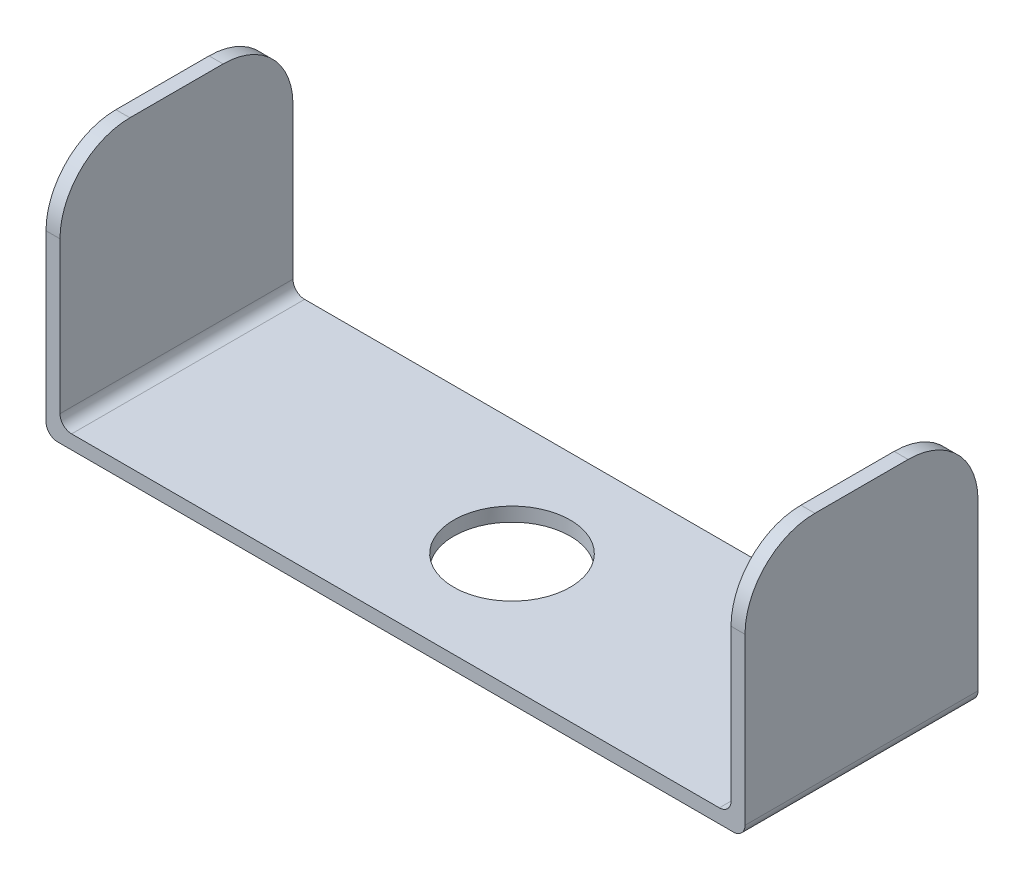
ISO-10303-21;
HEADER;
FILE_DESCRIPTION(('STEP AP214'),'2;1');
FILE_NAME('part.step','',(''),(''),'','','');
FILE_SCHEMA(('AUTOMOTIVE_DESIGN { 1 0 10303 214 1 1 1 1 }'));
ENDSEC;
DATA;
#1=APPLICATION_CONTEXT('core data for automotive mechanical design processes');
#2=APPLICATION_PROTOCOL_DEFINITION('international standard','automotive_design',2000,#1);
#3=PRODUCT_CONTEXT('',#1,'mechanical');
#4=PRODUCT('Part','Part','',(#3));
#5=PRODUCT_RELATED_PRODUCT_CATEGORY('part','',(#4));
#6=PRODUCT_DEFINITION_FORMATION('','',#4);
#7=PRODUCT_DEFINITION_CONTEXT('part definition',#1,'design');
#8=PRODUCT_DEFINITION('design','',#6,#7);
#9=PRODUCT_DEFINITION_SHAPE('','',#8);
#10=(LENGTH_UNIT() NAMED_UNIT(*) SI_UNIT(.MILLI.,.METRE.));
#11=(NAMED_UNIT(*) PLANE_ANGLE_UNIT() SI_UNIT($,.RADIAN.));
#12=(NAMED_UNIT(*) SI_UNIT($,.STERADIAN.) SOLID_ANGLE_UNIT());
#13=UNCERTAINTY_MEASURE_WITH_UNIT(LENGTH_MEASURE(1.E-05),#10,'distance_accuracy_value','');
#14=(GEOMETRIC_REPRESENTATION_CONTEXT(3) GLOBAL_UNCERTAINTY_ASSIGNED_CONTEXT((#13)) GLOBAL_UNIT_ASSIGNED_CONTEXT((#10,
#11,#12)) REPRESENTATION_CONTEXT('',''));
#15=CARTESIAN_POINT('',(0.,0.,0.));
#16=DIRECTION('',(0.,0.,1.));
#17=DIRECTION('',(1.,0.,0.));
#18=AXIS2_PLACEMENT_3D('',#15,#16,#17);
#19=CARTESIAN_POINT('',(0.,0.6,0.));
#20=DIRECTION('',(0.,-1.,0.));
#21=DIRECTION('',(0.,0.,-1.));
#22=AXIS2_PLACEMENT_3D('',#19,#20,#21);
#23=PLANE('',#22);
#24=CARTESIAN_POINT('',(0.,0.6,0.));
#25=DIRECTION('',(0.,1.,0.));
#26=DIRECTION('',(0.,0.,1.));
#27=AXIS2_PLACEMENT_3D('',#24,#25,#26);
#28=CIRCLE('',#27,2.5);
#29=CARTESIAN_POINT('',(0.,0.6,2.5));
#30=VERTEX_POINT('',#29);
#31=EDGE_CURVE('E255',#30,#30,#28,.T.);
#32=ORIENTED_EDGE('',*,*,#31,.F.);
#33=EDGE_LOOP('',(#32));
#34=FACE_BOUND('',#33,.T.);
#35=DIRECTION('',(1.,0.,0.));
#36=VECTOR('',#35,1.);
#37=CARTESIAN_POINT('',(-15.,0.6,5.));
#38=LINE('',#37,#36);
#39=CARTESIAN_POINT('',(-13.9,0.6,5.));
#40=VERTEX_POINT('',#39);
#41=CARTESIAN_POINT('',(13.9,0.6,5.));
#42=VERTEX_POINT('',#41);
#43=EDGE_CURVE('E246',#40,#42,#38,.T.);
#44=ORIENTED_EDGE('',*,*,#43,.T.);
#45=DIRECTION('',(0.,0.,1.));
#46=VECTOR('',#45,1.);
#47=CARTESIAN_POINT('',(13.9,0.6,-5.));
#48=LINE('',#47,#46);
#49=CARTESIAN_POINT('',(13.9,0.6,-5.));
#50=VERTEX_POINT('',#49);
#51=EDGE_CURVE('E190',#42,#50,#48,.F.);
#52=ORIENTED_EDGE('',*,*,#51,.T.);
#53=DIRECTION('',(-1.,0.,0.));
#54=VECTOR('',#53,1.);
#55=CARTESIAN_POINT('',(-15.,0.6,-5.));
#56=LINE('',#55,#54);
#57=CARTESIAN_POINT('',(-13.9,0.6,-5.));
#58=VERTEX_POINT('',#57);
#59=EDGE_CURVE('E271',#50,#58,#56,.T.);
#60=ORIENTED_EDGE('',*,*,#59,.T.);
#61=DIRECTION('',(0.,0.,-1.));
#62=VECTOR('',#61,1.);
#63=CARTESIAN_POINT('',(-13.9,0.6,5.));
#64=LINE('',#63,#62);
#65=EDGE_CURVE('E188',#58,#40,#64,.F.);
#66=ORIENTED_EDGE('',*,*,#65,.T.);
#67=EDGE_LOOP('',(#44,#52,#60,#66));
#68=FACE_BOUND('',#67,.T.);
#69=ADVANCED_FACE('F32',(#34,#68),#23,.F.);
#70=CARTESIAN_POINT('',(15.,0.6,5.));
#71=DIRECTION('',(-1.,0.,0.));
#72=DIRECTION('',(0.,0.,1.));
#73=AXIS2_PLACEMENT_3D('',#70,#71,#72);
#74=PLANE('',#73);
#75=DIRECTION('',(0.,-1.,0.));
#76=VECTOR('',#75,1.);
#77=CARTESIAN_POINT('',(15.,0.6,-5.));
#78=LINE('',#77,#76);
#79=CARTESIAN_POINT('',(15.,7.6,-5.));
#80=VERTEX_POINT('',#79);
#81=CARTESIAN_POINT('',(15.,0.5,-5.));
#82=VERTEX_POINT('',#81);
#83=EDGE_CURVE('E146',#80,#82,#78,.T.);
#84=ORIENTED_EDGE('',*,*,#83,.F.);
#85=CARTESIAN_POINT('',(15.,7.6,-2.));
#86=DIRECTION('',(-1.,0.,0.));
#87=DIRECTION('',(0.,0.,1.));
#88=AXIS2_PLACEMENT_3D('',#85,#86,#87);
#89=CIRCLE('',#88,3.);
#90=CARTESIAN_POINT('',(15.,10.6,-2.));
#91=VERTEX_POINT('',#90);
#92=EDGE_CURVE('E11',#80,#91,#89,.F.);
#93=ORIENTED_EDGE('',*,*,#92,.T.);
#94=DIRECTION('',(0.,0.,-1.));
#95=VECTOR('',#94,1.);
#96=CARTESIAN_POINT('',(15.,10.6,-5.));
#97=LINE('',#96,#95);
#98=CARTESIAN_POINT('',(15.,10.6,2.));
#99=VERTEX_POINT('',#98);
#100=EDGE_CURVE('E237',#99,#91,#97,.T.);
#101=ORIENTED_EDGE('',*,*,#100,.F.);
#102=CARTESIAN_POINT('',(15.,7.6,2.));
#103=DIRECTION('',(-1.,0.,0.));
#104=DIRECTION('',(0.,0.,1.));
#105=AXIS2_PLACEMENT_3D('',#102,#103,#104);
#106=CIRCLE('',#105,3.);
#107=CARTESIAN_POINT('',(15.,7.6,5.));
#108=VERTEX_POINT('',#107);
#109=EDGE_CURVE('E40',#99,#108,#106,.F.);
#110=ORIENTED_EDGE('',*,*,#109,.T.);
#111=DIRECTION('',(0.,-1.,0.));
#112=VECTOR('',#111,1.);
#113=CARTESIAN_POINT('',(15.,0.6,5.));
#114=LINE('',#113,#112);
#115=CARTESIAN_POINT('',(15.,0.5,5.));
#116=VERTEX_POINT('',#115);
#117=EDGE_CURVE('E172',#108,#116,#114,.T.);
#118=ORIENTED_EDGE('',*,*,#117,.T.);
#119=DIRECTION('',(0.,0.,-1.));
#120=VECTOR('',#119,1.);
#121=CARTESIAN_POINT('',(15.,0.5,-5.));
#122=LINE('',#121,#120);
#123=EDGE_CURVE('E158',#116,#82,#122,.T.);
#124=ORIENTED_EDGE('',*,*,#123,.T.);
#125=EDGE_LOOP('',(#84,#93,#101,#110,#118,#124));
#126=FACE_BOUND('',#125,.T.);
#127=ADVANCED_FACE('F170',(#126),#74,.F.);
#128=CARTESIAN_POINT('',(-15.,0.6,-5.));
#129=DIRECTION('',(0.,0.,1.));
#130=DIRECTION('',(1.,0.,0.));
#131=AXIS2_PLACEMENT_3D('',#128,#129,#130);
#132=PLANE('',#131);
#133=DIRECTION('',(0.,-1.,0.));
#134=VECTOR('',#133,1.);
#135=CARTESIAN_POINT('',(-15.,0.6,-5.));
#136=LINE('',#135,#134);
#137=CARTESIAN_POINT('',(-15.,7.6,-5.));
#138=VERTEX_POINT('',#137);
#139=CARTESIAN_POINT('',(-15.,0.5,-5.));
#140=VERTEX_POINT('',#139);
#141=EDGE_CURVE('E159',#138,#140,#136,.T.);
#142=ORIENTED_EDGE('',*,*,#141,.F.);
#143=DIRECTION('',(-1.,0.,0.));
#144=VECTOR('',#143,1.);
#145=CARTESIAN_POINT('',(-14.4,7.6,-5.));
#146=LINE('',#145,#144);
#147=CARTESIAN_POINT('',(-14.4,7.6,-5.));
#148=VERTEX_POINT('',#147);
#149=EDGE_CURVE('E219',#138,#148,#146,.F.);
#150=ORIENTED_EDGE('',*,*,#149,.T.);
#151=DIRECTION('',(0.,-1.,0.));
#152=VECTOR('',#151,1.);
#153=CARTESIAN_POINT('',(-14.4,10.6,-5.));
#154=LINE('',#153,#152);
#155=CARTESIAN_POINT('',(-14.4,1.1,-5.));
#156=VERTEX_POINT('',#155);
#157=EDGE_CURVE('E266',#148,#156,#154,.T.);
#158=ORIENTED_EDGE('',*,*,#157,.T.);
#159=CARTESIAN_POINT('',(-13.9,1.1,-5.));
#160=DIRECTION('',(0.,0.,1.));
#161=DIRECTION('',(1.,0.,0.));
#162=AXIS2_PLACEMENT_3D('',#159,#160,#161);
#163=CIRCLE('',#162,0.5);
#164=EDGE_CURVE('E203',#156,#58,#163,.T.);
#165=ORIENTED_EDGE('',*,*,#164,.T.);
#166=ORIENTED_EDGE('',*,*,#59,.F.);
#167=CARTESIAN_POINT('',(13.9,1.1,-5.));
#168=DIRECTION('',(0.,0.,1.));
#169=DIRECTION('',(1.,0.,0.));
#170=AXIS2_PLACEMENT_3D('',#167,#168,#169);
#171=CIRCLE('',#170,0.5);
#172=CARTESIAN_POINT('',(14.4,1.1,-5.));
#173=VERTEX_POINT('',#172);
#174=EDGE_CURVE('E200',#50,#173,#171,.T.);
#175=ORIENTED_EDGE('',*,*,#174,.T.);
#176=DIRECTION('',(0.,-1.,0.));
#177=VECTOR('',#176,1.);
#178=CARTESIAN_POINT('',(14.4,10.6,-5.));
#179=LINE('',#178,#177);
#180=CARTESIAN_POINT('',(14.4,7.6,-5.));
#181=VERTEX_POINT('',#180);
#182=EDGE_CURVE('E253',#181,#173,#179,.T.);
#183=ORIENTED_EDGE('',*,*,#182,.F.);
#184=DIRECTION('',(-1.,0.,0.));
#185=VECTOR('',#184,1.);
#186=CARTESIAN_POINT('',(-15.,7.6,-5.));
#187=LINE('',#186,#185);
#188=EDGE_CURVE('E154',#181,#80,#187,.F.);
#189=ORIENTED_EDGE('',*,*,#188,.T.);
#190=ORIENTED_EDGE('',*,*,#83,.T.);
#191=CARTESIAN_POINT('',(14.5,0.5,-5.));
#192=DIRECTION('',(0.,0.,1.));
#193=DIRECTION('',(1.,0.,0.));
#194=AXIS2_PLACEMENT_3D('',#191,#192,#193);
#195=CIRCLE('',#194,0.5);
#196=CARTESIAN_POINT('',(14.5,0.,-5.));
#197=VERTEX_POINT('',#196);
#198=EDGE_CURVE('E151',#82,#197,#195,.F.);
#199=ORIENTED_EDGE('',*,*,#198,.T.);
#200=DIRECTION('',(-1.,0.,0.));
#201=VECTOR('',#200,1.);
#202=CARTESIAN_POINT('',(-15.,0.,-5.));
#203=LINE('',#202,#201);
#204=CARTESIAN_POINT('',(-14.5,0.,-5.));
#205=VERTEX_POINT('',#204);
#206=EDGE_CURVE('E270',#197,#205,#203,.T.);
#207=ORIENTED_EDGE('',*,*,#206,.T.);
#208=CARTESIAN_POINT('',(-14.5,0.5,-5.));
#209=DIRECTION('',(0.,0.,1.));
#210=DIRECTION('',(1.,0.,0.));
#211=AXIS2_PLACEMENT_3D('',#208,#209,#210);
#212=CIRCLE('',#211,0.5);
#213=EDGE_CURVE('E168',#205,#140,#212,.F.);
#214=ORIENTED_EDGE('',*,*,#213,.T.);
#215=EDGE_LOOP('',(#142,#150,#158,#165,#166,#175,#183,#189,#190,#199,#207,#214));
#216=FACE_BOUND('',#215,.T.);
#217=ADVANCED_FACE('F149',(#216),#132,.F.);
#218=CARTESIAN_POINT('',(-15.,0.6,5.));
#219=DIRECTION('',(1.,0.,0.));
#220=DIRECTION('',(0.,0.,-1.));
#221=AXIS2_PLACEMENT_3D('',#218,#219,#220);
#222=PLANE('',#221);
#223=DIRECTION('',(0.,0.,1.));
#224=VECTOR('',#223,1.);
#225=CARTESIAN_POINT('',(-15.,10.6,-5.));
#226=LINE('',#225,#224);
#227=CARTESIAN_POINT('',(-15.,10.6,-2.));
#228=VERTEX_POINT('',#227);
#229=CARTESIAN_POINT('',(-15.,10.6,2.));
#230=VERTEX_POINT('',#229);
#231=EDGE_CURVE('E260',#228,#230,#226,.T.);
#232=ORIENTED_EDGE('',*,*,#231,.F.);
#233=CARTESIAN_POINT('',(-15.,7.6,-2.));
#234=DIRECTION('',(1.,0.,0.));
#235=DIRECTION('',(0.,0.,-1.));
#236=AXIS2_PLACEMENT_3D('',#233,#234,#235);
#237=CIRCLE('',#236,3.);
#238=EDGE_CURVE('E216',#228,#138,#237,.F.);
#239=ORIENTED_EDGE('',*,*,#238,.T.);
#240=ORIENTED_EDGE('',*,*,#141,.T.);
#241=DIRECTION('',(0.,0.,1.));
#242=VECTOR('',#241,1.);
#243=CARTESIAN_POINT('',(-15.,0.5,5.));
#244=LINE('',#243,#242);
#245=CARTESIAN_POINT('',(-15.,0.5,5.));
#246=VERTEX_POINT('',#245);
#247=EDGE_CURVE('E192',#140,#246,#244,.T.);
#248=ORIENTED_EDGE('',*,*,#247,.T.);
#249=DIRECTION('',(0.,-1.,0.));
#250=VECTOR('',#249,1.);
#251=CARTESIAN_POINT('',(-15.,0.6,5.));
#252=LINE('',#251,#250);
#253=CARTESIAN_POINT('',(-15.,7.6,5.));
#254=VERTEX_POINT('',#253);
#255=EDGE_CURVE('E245',#254,#246,#252,.T.);
#256=ORIENTED_EDGE('',*,*,#255,.F.);
#257=CARTESIAN_POINT('',(-15.,7.6,2.));
#258=DIRECTION('',(1.,0.,0.));
#259=DIRECTION('',(0.,0.,-1.));
#260=AXIS2_PLACEMENT_3D('',#257,#258,#259);
#261=CIRCLE('',#260,3.);
#262=EDGE_CURVE('E214',#254,#230,#261,.F.);
#263=ORIENTED_EDGE('',*,*,#262,.T.);
#264=EDGE_LOOP('',(#232,#239,#240,#248,#256,#263));
#265=FACE_BOUND('',#264,.T.);
#266=ADVANCED_FACE('F281',(#265),#222,.F.);
#267=CARTESIAN_POINT('',(-15.,0.6,5.));
#268=DIRECTION('',(0.,0.,-1.));
#269=DIRECTION('',(-1.,0.,0.));
#270=AXIS2_PLACEMENT_3D('',#267,#268,#269);
#271=PLANE('',#270);
#272=DIRECTION('',(0.,-1.,0.));
#273=VECTOR('',#272,1.);
#274=CARTESIAN_POINT('',(-14.4,10.6,5.));
#275=LINE('',#274,#273);
#276=CARTESIAN_POINT('',(-14.4,7.6,5.));
#277=VERTEX_POINT('',#276);
#278=CARTESIAN_POINT('',(-14.4,1.1,5.));
#279=VERTEX_POINT('',#278);
#280=EDGE_CURVE('E268',#277,#279,#275,.T.);
#281=ORIENTED_EDGE('',*,*,#280,.F.);
#282=DIRECTION('',(1.,0.,0.));
#283=VECTOR('',#282,1.);
#284=CARTESIAN_POINT('',(-15.,7.6,5.));
#285=LINE('',#284,#283);
#286=EDGE_CURVE('E227',#277,#254,#285,.F.);
#287=ORIENTED_EDGE('',*,*,#286,.T.);
#288=ORIENTED_EDGE('',*,*,#255,.T.);
#289=CARTESIAN_POINT('',(-14.5,0.5,5.));
#290=DIRECTION('',(0.,0.,-1.));
#291=DIRECTION('',(-1.,0.,0.));
#292=AXIS2_PLACEMENT_3D('',#289,#290,#291);
#293=CIRCLE('',#292,0.5);
#294=CARTESIAN_POINT('',(-14.5,0.,5.));
#295=VERTEX_POINT('',#294);
#296=EDGE_CURVE('E181',#246,#295,#293,.F.);
#297=ORIENTED_EDGE('',*,*,#296,.T.);
#298=DIRECTION('',(1.,0.,0.));
#299=VECTOR('',#298,1.);
#300=CARTESIAN_POINT('',(-15.,0.,5.));
#301=LINE('',#300,#299);
#302=CARTESIAN_POINT('',(14.5,0.,5.));
#303=VERTEX_POINT('',#302);
#304=EDGE_CURVE('E274',#295,#303,#301,.T.);
#305=ORIENTED_EDGE('',*,*,#304,.T.);
#306=CARTESIAN_POINT('',(14.5,0.5,5.));
#307=DIRECTION('',(0.,0.,-1.));
#308=DIRECTION('',(-1.,0.,0.));
#309=AXIS2_PLACEMENT_3D('',#306,#307,#308);
#310=CIRCLE('',#309,0.5);
#311=EDGE_CURVE('E183',#303,#116,#310,.F.);
#312=ORIENTED_EDGE('',*,*,#311,.T.);
#313=ORIENTED_EDGE('',*,*,#117,.F.);
#314=DIRECTION('',(1.,0.,0.));
#315=VECTOR('',#314,1.);
#316=CARTESIAN_POINT('',(-15.,7.6,5.));
#317=LINE('',#316,#315);
#318=CARTESIAN_POINT('',(14.4,7.6,5.));
#319=VERTEX_POINT('',#318);
#320=EDGE_CURVE('E225',#108,#319,#317,.F.);
#321=ORIENTED_EDGE('',*,*,#320,.T.);
#322=DIRECTION('',(0.,-1.,0.));
#323=VECTOR('',#322,1.);
#324=CARTESIAN_POINT('',(14.4,10.6,5.));
#325=LINE('',#324,#323);
#326=CARTESIAN_POINT('',(14.4,1.1,5.));
#327=VERTEX_POINT('',#326);
#328=EDGE_CURVE('E251',#319,#327,#325,.T.);
#329=ORIENTED_EDGE('',*,*,#328,.T.);
#330=CARTESIAN_POINT('',(13.9,1.1,5.));
#331=DIRECTION('',(0.,0.,-1.));
#332=DIRECTION('',(-1.,0.,0.));
#333=AXIS2_PLACEMENT_3D('',#330,#331,#332);
#334=CIRCLE('',#333,0.5);
#335=EDGE_CURVE('E198',#327,#42,#334,.T.);
#336=ORIENTED_EDGE('',*,*,#335,.T.);
#337=ORIENTED_EDGE('',*,*,#43,.F.);
#338=CARTESIAN_POINT('',(-13.9,1.1,5.));
#339=DIRECTION('',(0.,0.,-1.));
#340=DIRECTION('',(-1.,0.,0.));
#341=AXIS2_PLACEMENT_3D('',#338,#339,#340);
#342=CIRCLE('',#341,0.5);
#343=EDGE_CURVE('E205',#40,#279,#342,.T.);
#344=ORIENTED_EDGE('',*,*,#343,.T.);
#345=EDGE_LOOP('',(#281,#287,#288,#297,#305,#312,#313,#321,#329,#336,#337,#344));
#346=FACE_BOUND('',#345,.T.);
#347=ADVANCED_FACE('F243',(#346),#271,.F.);
#348=CARTESIAN_POINT('',(0.,0.,0.));
#349=DIRECTION('',(0.,-1.,0.));
#350=DIRECTION('',(0.,0.,-1.));
#351=AXIS2_PLACEMENT_3D('',#348,#349,#350);
#352=PLANE('',#351);
#353=CARTESIAN_POINT('',(0.,0.,0.));
#354=DIRECTION('',(0.,-1.,0.));
#355=DIRECTION('',(0.,0.,-1.));
#356=AXIS2_PLACEMENT_3D('',#353,#354,#355);
#357=CIRCLE('',#356,2.5);
#358=CARTESIAN_POINT('',(0.,0.,-2.5));
#359=VERTEX_POINT('',#358);
#360=EDGE_CURVE('E333',#359,#359,#357,.F.);
#361=ORIENTED_EDGE('',*,*,#360,.T.);
#362=EDGE_LOOP('',(#361));
#363=FACE_BOUND('',#362,.T.);
#364=ORIENTED_EDGE('',*,*,#206,.F.);
#365=DIRECTION('',(0.,0.,-1.));
#366=VECTOR('',#365,1.);
#367=CARTESIAN_POINT('',(14.5,0.,5.));
#368=LINE('',#367,#366);
#369=EDGE_CURVE('E166',#197,#303,#368,.F.);
#370=ORIENTED_EDGE('',*,*,#369,.T.);
#371=ORIENTED_EDGE('',*,*,#304,.F.);
#372=DIRECTION('',(0.,0.,1.));
#373=VECTOR('',#372,1.);
#374=CARTESIAN_POINT('',(-14.5,0.,-5.));
#375=LINE('',#374,#373);
#376=EDGE_CURVE('E167',#295,#205,#375,.F.);
#377=ORIENTED_EDGE('',*,*,#376,.T.);
#378=EDGE_LOOP('',(#364,#370,#371,#377));
#379=FACE_BOUND('',#378,.T.);
#380=ADVANCED_FACE('F292',(#363,#379),#352,.T.);
#381=CARTESIAN_POINT('',(-14.4,10.6,-5.));
#382=DIRECTION('',(-1.,0.,0.));
#383=DIRECTION('',(0.,0.,1.));
#384=AXIS2_PLACEMENT_3D('',#381,#382,#383);
#385=PLANE('',#384);
#386=ORIENTED_EDGE('',*,*,#157,.F.);
#387=CARTESIAN_POINT('',(-14.4,7.6,-2.));
#388=DIRECTION('',(-1.,0.,0.));
#389=DIRECTION('',(0.,0.,1.));
#390=AXIS2_PLACEMENT_3D('',#387,#388,#389);
#391=CIRCLE('',#390,3.);
#392=CARTESIAN_POINT('',(-14.4,10.6,-2.));
#393=VERTEX_POINT('',#392);
#394=EDGE_CURVE('E223',#148,#393,#391,.F.);
#395=ORIENTED_EDGE('',*,*,#394,.T.);
#396=DIRECTION('',(0.,0.,-1.));
#397=VECTOR('',#396,1.);
#398=CARTESIAN_POINT('',(-14.4,10.6,-5.));
#399=LINE('',#398,#397);
#400=CARTESIAN_POINT('',(-14.4,10.6,2.));
#401=VERTEX_POINT('',#400);
#402=EDGE_CURVE('E263',#401,#393,#399,.T.);
#403=ORIENTED_EDGE('',*,*,#402,.F.);
#404=CARTESIAN_POINT('',(-14.4,7.6,2.));
#405=DIRECTION('',(-1.,0.,0.));
#406=DIRECTION('',(0.,0.,1.));
#407=AXIS2_PLACEMENT_3D('',#404,#405,#406);
#408=CIRCLE('',#407,3.);
#409=EDGE_CURVE('E221',#401,#277,#408,.F.);
#410=ORIENTED_EDGE('',*,*,#409,.T.);
#411=ORIENTED_EDGE('',*,*,#280,.T.);
#412=DIRECTION('',(0.,0.,-1.));
#413=VECTOR('',#412,1.);
#414=CARTESIAN_POINT('',(-14.4,1.1,-5.));
#415=LINE('',#414,#413);
#416=EDGE_CURVE('E195',#279,#156,#415,.T.);
#417=ORIENTED_EDGE('',*,*,#416,.T.);
#418=EDGE_LOOP('',(#386,#395,#403,#410,#411,#417));
#419=FACE_BOUND('',#418,.T.);
#420=ADVANCED_FACE('F294',(#419),#385,.F.);
#421=CARTESIAN_POINT('',(0.,10.6,0.));
#422=DIRECTION('',(0.,1.,0.));
#423=DIRECTION('',(0.,0.,1.));
#424=AXIS2_PLACEMENT_3D('',#421,#422,#423);
#425=PLANE('',#424);
#426=ORIENTED_EDGE('',*,*,#402,.T.);
#427=DIRECTION('',(-1.,0.,0.));
#428=VECTOR('',#427,1.);
#429=CARTESIAN_POINT('',(-15.,10.6,-2.));
#430=LINE('',#429,#428);
#431=EDGE_CURVE('E211',#393,#228,#430,.T.);
#432=ORIENTED_EDGE('',*,*,#431,.T.);
#433=ORIENTED_EDGE('',*,*,#231,.T.);
#434=DIRECTION('',(1.,0.,0.));
#435=VECTOR('',#434,1.);
#436=CARTESIAN_POINT('',(-14.4,10.6,2.));
#437=LINE('',#436,#435);
#438=EDGE_CURVE('E208',#230,#401,#437,.T.);
#439=ORIENTED_EDGE('',*,*,#438,.T.);
#440=EDGE_LOOP('',(#426,#432,#433,#439));
#441=FACE_BOUND('',#440,.T.);
#442=ADVANCED_FACE('F301',(#441),#425,.T.);
#443=CARTESIAN_POINT('',(14.4,10.6,-5.));
#444=DIRECTION('',(1.,0.,0.));
#445=DIRECTION('',(0.,0.,-1.));
#446=AXIS2_PLACEMENT_3D('',#443,#444,#445);
#447=PLANE('',#446);
#448=DIRECTION('',(0.,0.,1.));
#449=VECTOR('',#448,1.);
#450=CARTESIAN_POINT('',(14.4,10.6,-5.));
#451=LINE('',#450,#449);
#452=CARTESIAN_POINT('',(14.4,10.6,-2.));
#453=VERTEX_POINT('',#452);
#454=CARTESIAN_POINT('',(14.4,10.6,2.));
#455=VERTEX_POINT('',#454);
#456=EDGE_CURVE('E250',#453,#455,#451,.T.);
#457=ORIENTED_EDGE('',*,*,#456,.F.);
#458=CARTESIAN_POINT('',(14.4,7.6,-2.));
#459=DIRECTION('',(1.,0.,0.));
#460=DIRECTION('',(0.,0.,-1.));
#461=AXIS2_PLACEMENT_3D('',#458,#459,#460);
#462=CIRCLE('',#461,3.);
#463=EDGE_CURVE('E55',#453,#181,#462,.F.);
#464=ORIENTED_EDGE('',*,*,#463,.T.);
#465=ORIENTED_EDGE('',*,*,#182,.T.);
#466=DIRECTION('',(0.,0.,1.));
#467=VECTOR('',#466,1.);
#468=CARTESIAN_POINT('',(14.4,1.1,5.));
#469=LINE('',#468,#467);
#470=EDGE_CURVE('E185',#173,#327,#469,.T.);
#471=ORIENTED_EDGE('',*,*,#470,.T.);
#472=ORIENTED_EDGE('',*,*,#328,.F.);
#473=CARTESIAN_POINT('',(14.4,7.6,2.));
#474=DIRECTION('',(1.,0.,0.));
#475=DIRECTION('',(0.,0.,-1.));
#476=AXIS2_PLACEMENT_3D('',#473,#474,#475);
#477=CIRCLE('',#476,3.);
#478=EDGE_CURVE('E47',#319,#455,#477,.F.);
#479=ORIENTED_EDGE('',*,*,#478,.T.);
#480=EDGE_LOOP('',(#457,#464,#465,#471,#472,#479));
#481=FACE_BOUND('',#480,.T.);
#482=ADVANCED_FACE('F318',(#481),#447,.F.);
#483=CARTESIAN_POINT('',(0.,10.6,0.));
#484=DIRECTION('',(0.,-1.,0.));
#485=DIRECTION('',(0.,0.,-1.));
#486=AXIS2_PLACEMENT_3D('',#483,#484,#485);
#487=PLANE('',#486);
#488=ORIENTED_EDGE('',*,*,#100,.T.);
#489=DIRECTION('',(-1.,0.,0.));
#490=VECTOR('',#489,1.);
#491=CARTESIAN_POINT('',(0.,10.6,-2.));
#492=LINE('',#491,#490);
#493=EDGE_CURVE('E232',#91,#453,#492,.T.);
#494=ORIENTED_EDGE('',*,*,#493,.T.);
#495=ORIENTED_EDGE('',*,*,#456,.T.);
#496=DIRECTION('',(1.,0.,0.));
#497=VECTOR('',#496,1.);
#498=CARTESIAN_POINT('',(0.,10.6,2.));
#499=LINE('',#498,#497);
#500=EDGE_CURVE('E229',#455,#99,#499,.T.);
#501=ORIENTED_EDGE('',*,*,#500,.T.);
#502=EDGE_LOOP('',(#488,#494,#495,#501));
#503=FACE_BOUND('',#502,.T.);
#504=ADVANCED_FACE('F249',(#503),#487,.F.);
#505=CARTESIAN_POINT('',(14.5,0.5,5.));
#506=DIRECTION('',(0.,0.,1.));
#507=DIRECTION('',(1.,0.,0.));
#508=AXIS2_PLACEMENT_3D('',#505,#506,#507);
#509=CYLINDRICAL_SURFACE('',#508,0.5);
#510=ORIENTED_EDGE('',*,*,#311,.F.);
#511=ORIENTED_EDGE('',*,*,#369,.F.);
#512=ORIENTED_EDGE('',*,*,#198,.F.);
#513=ORIENTED_EDGE('',*,*,#123,.F.);
#514=EDGE_LOOP('',(#510,#511,#512,#513));
#515=FACE_BOUND('',#514,.T.);
#516=ADVANCED_FACE('F165',(#515),#509,.T.);
#517=CARTESIAN_POINT('',(13.9,1.1,-5.));
#518=DIRECTION('',(0.,0.,-1.));
#519=DIRECTION('',(-1.,0.,0.));
#520=AXIS2_PLACEMENT_3D('',#517,#518,#519);
#521=CYLINDRICAL_SURFACE('',#520,0.5);
#522=ORIENTED_EDGE('',*,*,#174,.F.);
#523=ORIENTED_EDGE('',*,*,#51,.F.);
#524=ORIENTED_EDGE('',*,*,#335,.F.);
#525=ORIENTED_EDGE('',*,*,#470,.F.);
#526=EDGE_LOOP('',(#522,#523,#524,#525));
#527=FACE_BOUND('',#526,.T.);
#528=ADVANCED_FACE('F356',(#527),#521,.F.);
#529=CARTESIAN_POINT('',(-14.5,0.5,5.));
#530=DIRECTION('',(0.,0.,-1.));
#531=DIRECTION('',(-1.,0.,0.));
#532=AXIS2_PLACEMENT_3D('',#529,#530,#531);
#533=CYLINDRICAL_SURFACE('',#532,0.5);
#534=ORIENTED_EDGE('',*,*,#213,.F.);
#535=ORIENTED_EDGE('',*,*,#376,.F.);
#536=ORIENTED_EDGE('',*,*,#296,.F.);
#537=ORIENTED_EDGE('',*,*,#247,.F.);
#538=EDGE_LOOP('',(#534,#535,#536,#537));
#539=FACE_BOUND('',#538,.T.);
#540=ADVANCED_FACE('F289',(#539),#533,.T.);
#541=CARTESIAN_POINT('',(-13.9,1.1,-5.));
#542=DIRECTION('',(0.,0.,1.));
#543=DIRECTION('',(1.,0.,0.));
#544=AXIS2_PLACEMENT_3D('',#541,#542,#543);
#545=CYLINDRICAL_SURFACE('',#544,0.5);
#546=ORIENTED_EDGE('',*,*,#343,.F.);
#547=ORIENTED_EDGE('',*,*,#65,.F.);
#548=ORIENTED_EDGE('',*,*,#164,.F.);
#549=ORIENTED_EDGE('',*,*,#416,.F.);
#550=EDGE_LOOP('',(#546,#547,#548,#549));
#551=FACE_BOUND('',#550,.T.);
#552=ADVANCED_FACE('F349',(#551),#545,.F.);
#553=CARTESIAN_POINT('',(0.,7.6,-2.));
#554=DIRECTION('',(1.,0.,0.));
#555=DIRECTION('',(0.,0.,-1.));
#556=AXIS2_PLACEMENT_3D('',#553,#554,#555);
#557=CYLINDRICAL_SURFACE('',#556,3.);
#558=ORIENTED_EDGE('',*,*,#394,.F.);
#559=ORIENTED_EDGE('',*,*,#149,.F.);
#560=ORIENTED_EDGE('',*,*,#238,.F.);
#561=ORIENTED_EDGE('',*,*,#431,.F.);
#562=EDGE_LOOP('',(#558,#559,#560,#561));
#563=FACE_BOUND('',#562,.T.);
#564=ADVANCED_FACE('F343',(#563),#557,.T.);
#565=CARTESIAN_POINT('',(0.,7.6,2.));
#566=DIRECTION('',(-1.,0.,0.));
#567=DIRECTION('',(0.,0.,1.));
#568=AXIS2_PLACEMENT_3D('',#565,#566,#567);
#569=CYLINDRICAL_SURFACE('',#568,3.);
#570=ORIENTED_EDGE('',*,*,#262,.F.);
#571=ORIENTED_EDGE('',*,*,#286,.F.);
#572=ORIENTED_EDGE('',*,*,#409,.F.);
#573=ORIENTED_EDGE('',*,*,#438,.F.);
#574=EDGE_LOOP('',(#570,#571,#572,#573));
#575=FACE_BOUND('',#574,.T.);
#576=ADVANCED_FACE('F339',(#575),#569,.T.);
#577=CARTESIAN_POINT('',(0.,7.6,-2.));
#578=DIRECTION('',(-1.,0.,0.));
#579=DIRECTION('',(0.,0.,1.));
#580=AXIS2_PLACEMENT_3D('',#577,#578,#579);
#581=CYLINDRICAL_SURFACE('',#580,3.);
#582=ORIENTED_EDGE('',*,*,#92,.F.);
#583=ORIENTED_EDGE('',*,*,#188,.F.);
#584=ORIENTED_EDGE('',*,*,#463,.F.);
#585=ORIENTED_EDGE('',*,*,#493,.F.);
#586=EDGE_LOOP('',(#582,#583,#584,#585));
#587=FACE_BOUND('',#586,.T.);
#588=ADVANCED_FACE('F330',(#587),#581,.T.);
#589=CARTESIAN_POINT('',(0.,7.6,2.));
#590=DIRECTION('',(1.,0.,0.));
#591=DIRECTION('',(0.,0.,-1.));
#592=AXIS2_PLACEMENT_3D('',#589,#590,#591);
#593=CYLINDRICAL_SURFACE('',#592,3.);
#594=ORIENTED_EDGE('',*,*,#478,.F.);
#595=ORIENTED_EDGE('',*,*,#320,.F.);
#596=ORIENTED_EDGE('',*,*,#109,.F.);
#597=ORIENTED_EDGE('',*,*,#500,.F.);
#598=EDGE_LOOP('',(#594,#595,#596,#597));
#599=FACE_BOUND('',#598,.T.);
#600=ADVANCED_FACE('F34',(#599),#593,.T.);
#601=CARTESIAN_POINT('',(0.,-0.00100000000000002,0.));
#602=DIRECTION('',(0.,1.,0.));
#603=DIRECTION('',(0.,0.,1.));
#604=AXIS2_PLACEMENT_3D('',#601,#602,#603);
#605=CYLINDRICAL_SURFACE('',#604,2.5);
#606=ORIENTED_EDGE('',*,*,#360,.F.);
#607=EDGE_LOOP('',(#606));
#608=FACE_BOUND('',#607,.T.);
#609=ORIENTED_EDGE('',*,*,#31,.T.);
#610=EDGE_LOOP('',(#609));
#611=FACE_BOUND('',#610,.T.);
#612=ADVANCED_FACE('F324',(#608,#611),#605,.F.);
#613=CLOSED_SHELL('',(#69,#127,#217,#266,#347,#380,#420,#442,#482,#504,#516,#528,#540,#552,#564,
#576,#588,#600,#612));
#614=MANIFOLD_SOLID_BREP('B2',#613);
#615=ADVANCED_BREP_SHAPE_REPRESENTATION('',(#18,#614),#14);
#616=SHAPE_DEFINITION_REPRESENTATION(#9,#615);
ENDSEC;
END-ISO-10303-21;
